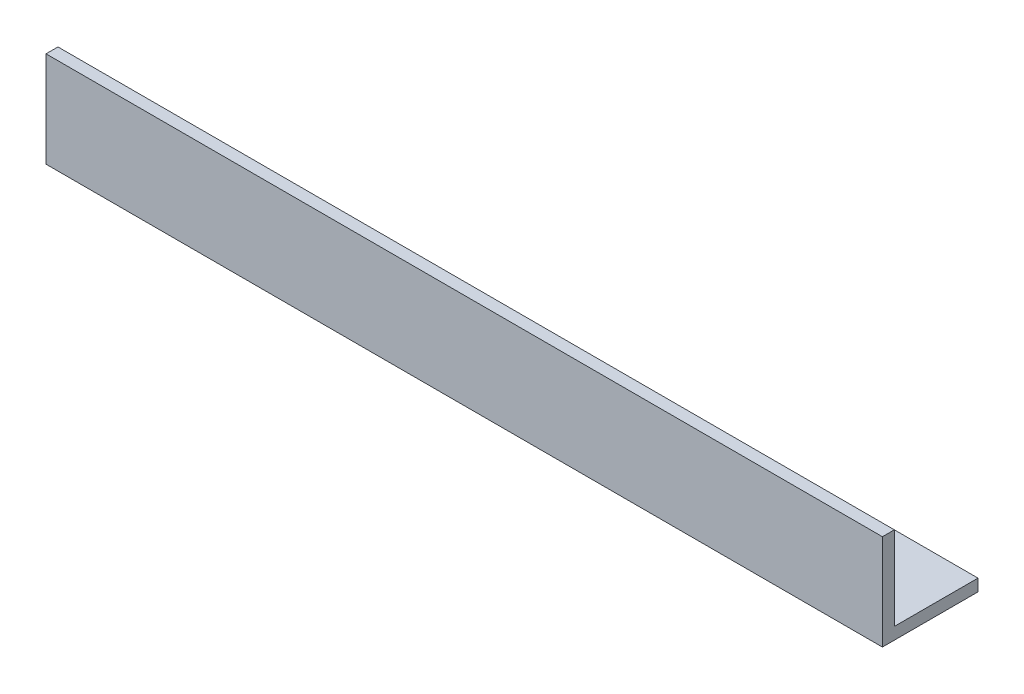
ISO-10303-21;
HEADER;
FILE_DESCRIPTION(('STEP AP214'),'2;1');
FILE_NAME('part.step','',(''),(''),'','','');
FILE_SCHEMA(('AUTOMOTIVE_DESIGN { 1 0 10303 214 1 1 1 1 }'));
ENDSEC;
DATA;
#1=APPLICATION_CONTEXT('core data for automotive mechanical design processes');
#2=APPLICATION_PROTOCOL_DEFINITION('international standard','automotive_design',2000,#1);
#3=PRODUCT_CONTEXT('',#1,'mechanical');
#4=PRODUCT('Part','Part','',(#3));
#5=PRODUCT_RELATED_PRODUCT_CATEGORY('part','',(#4));
#6=PRODUCT_DEFINITION_FORMATION('','',#4);
#7=PRODUCT_DEFINITION_CONTEXT('part definition',#1,'design');
#8=PRODUCT_DEFINITION('design','',#6,#7);
#9=PRODUCT_DEFINITION_SHAPE('','',#8);
#10=(LENGTH_UNIT() NAMED_UNIT(*) SI_UNIT(.MILLI.,.METRE.));
#11=(NAMED_UNIT(*) PLANE_ANGLE_UNIT() SI_UNIT($,.RADIAN.));
#12=(NAMED_UNIT(*) SI_UNIT($,.STERADIAN.) SOLID_ANGLE_UNIT());
#13=UNCERTAINTY_MEASURE_WITH_UNIT(LENGTH_MEASURE(1.E-05),#10,'distance_accuracy_value','');
#14=(GEOMETRIC_REPRESENTATION_CONTEXT(3) GLOBAL_UNCERTAINTY_ASSIGNED_CONTEXT((#13)) GLOBAL_UNIT_ASSIGNED_CONTEXT((#10,
#11,#12)) REPRESENTATION_CONTEXT('',''));
#15=CARTESIAN_POINT('',(0.,0.,0.));
#16=DIRECTION('',(0.,0.,1.));
#17=DIRECTION('',(1.,0.,0.));
#18=AXIS2_PLACEMENT_3D('',#15,#16,#17);
#19=CARTESIAN_POINT('',(111.125,0.,-25.4));
#20=DIRECTION('',(0.,1.,0.));
#21=DIRECTION('',(0.,0.,1.));
#22=AXIS2_PLACEMENT_3D('',#19,#20,#21);
#23=PLANE('',#22);
#24=DIRECTION('',(0.,0.,-1.));
#25=VECTOR('',#24,1.);
#26=CARTESIAN_POINT('',(-111.125,0.,-25.4));
#27=LINE('',#26,#25);
#28=CARTESIAN_POINT('',(-111.125,0.,0.));
#29=VERTEX_POINT('',#28);
#30=CARTESIAN_POINT('',(-111.125,0.,-25.4));
#31=VERTEX_POINT('',#30);
#32=EDGE_CURVE('E132',#29,#31,#27,.T.);
#33=ORIENTED_EDGE('',*,*,#32,.T.);
#34=DIRECTION('',(-1.,0.,0.));
#35=VECTOR('',#34,1.);
#36=CARTESIAN_POINT('',(111.125,0.,-25.4));
#37=LINE('',#36,#35);
#38=CARTESIAN_POINT('',(111.125,0.,-25.4));
#39=VERTEX_POINT('',#38);
#40=EDGE_CURVE('E11',#39,#31,#37,.T.);
#41=ORIENTED_EDGE('',*,*,#40,.F.);
#42=DIRECTION('',(0.,0.,-1.));
#43=VECTOR('',#42,1.);
#44=CARTESIAN_POINT('',(111.125,0.,-25.4));
#45=LINE('',#44,#43);
#46=CARTESIAN_POINT('',(111.125,0.,0.));
#47=VERTEX_POINT('',#46);
#48=EDGE_CURVE('E148',#47,#39,#45,.T.);
#49=ORIENTED_EDGE('',*,*,#48,.F.);
#50=DIRECTION('',(-1.,0.,0.));
#51=VECTOR('',#50,1.);
#52=CARTESIAN_POINT('',(111.125,0.,0.));
#53=LINE('',#52,#51);
#54=EDGE_CURVE('E128',#47,#29,#53,.T.);
#55=ORIENTED_EDGE('',*,*,#54,.T.);
#56=EDGE_LOOP('',(#33,#41,#49,#55));
#57=FACE_BOUND('',#56,.T.);
#58=ADVANCED_FACE('F43',(#57),#23,.F.);
#59=CARTESIAN_POINT('',(111.125,3.175,-25.4));
#60=DIRECTION('',(0.,0.,1.));
#61=DIRECTION('',(0.,-1.,0.));
#62=AXIS2_PLACEMENT_3D('',#59,#60,#61);
#63=PLANE('',#62);
#64=DIRECTION('',(0.,1.,0.));
#65=VECTOR('',#64,1.);
#66=CARTESIAN_POINT('',(-111.125,3.175,-25.4));
#67=LINE('',#66,#65);
#68=CARTESIAN_POINT('',(-111.125,3.175,-25.4));
#69=VERTEX_POINT('',#68);
#70=EDGE_CURVE('E136',#31,#69,#67,.T.);
#71=ORIENTED_EDGE('',*,*,#70,.T.);
#72=DIRECTION('',(-1.,0.,0.));
#73=VECTOR('',#72,1.);
#74=CARTESIAN_POINT('',(111.125,3.175,-25.4));
#75=LINE('',#74,#73);
#76=CARTESIAN_POINT('',(111.125,3.175,-25.4));
#77=VERTEX_POINT('',#76);
#78=EDGE_CURVE('E52',#77,#69,#75,.T.);
#79=ORIENTED_EDGE('',*,*,#78,.F.);
#80=DIRECTION('',(0.,1.,0.));
#81=VECTOR('',#80,1.);
#82=CARTESIAN_POINT('',(111.125,3.175,-25.4));
#83=LINE('',#82,#81);
#84=EDGE_CURVE('E97',#39,#77,#83,.T.);
#85=ORIENTED_EDGE('',*,*,#84,.F.);
#86=ORIENTED_EDGE('',*,*,#40,.T.);
#87=EDGE_LOOP('',(#71,#79,#85,#86));
#88=FACE_BOUND('',#87,.T.);
#89=ADVANCED_FACE('F176',(#88),#63,.F.);
#90=CARTESIAN_POINT('',(111.125,3.175,-3.175));
#91=DIRECTION('',(0.,-1.,0.));
#92=DIRECTION('',(0.,0.,-1.));
#93=AXIS2_PLACEMENT_3D('',#90,#91,#92);
#94=PLANE('',#93);
#95=DIRECTION('',(0.,0.,1.));
#96=VECTOR('',#95,1.);
#97=CARTESIAN_POINT('',(-111.125,3.175,-3.175));
#98=LINE('',#97,#96);
#99=CARTESIAN_POINT('',(-111.125,3.175,-3.175));
#100=VERTEX_POINT('',#99);
#101=EDGE_CURVE('E139',#69,#100,#98,.T.);
#102=ORIENTED_EDGE('',*,*,#101,.T.);
#103=DIRECTION('',(-1.,0.,0.));
#104=VECTOR('',#103,1.);
#105=CARTESIAN_POINT('',(111.125,3.175,-3.175));
#106=LINE('',#105,#104);
#107=CARTESIAN_POINT('',(111.125,3.175,-3.175));
#108=VERTEX_POINT('',#107);
#109=EDGE_CURVE('E121',#108,#100,#106,.T.);
#110=ORIENTED_EDGE('',*,*,#109,.F.);
#111=DIRECTION('',(0.,0.,1.));
#112=VECTOR('',#111,1.);
#113=CARTESIAN_POINT('',(111.125,3.175,-3.175));
#114=LINE('',#113,#112);
#115=EDGE_CURVE('E110',#77,#108,#114,.T.);
#116=ORIENTED_EDGE('',*,*,#115,.F.);
#117=ORIENTED_EDGE('',*,*,#78,.T.);
#118=EDGE_LOOP('',(#102,#110,#116,#117));
#119=FACE_BOUND('',#118,.T.);
#120=ADVANCED_FACE('F158',(#119),#94,.F.);
#121=CARTESIAN_POINT('',(111.125,25.4,-3.175));
#122=DIRECTION('',(0.,0.,1.));
#123=DIRECTION('',(0.,-1.,0.));
#124=AXIS2_PLACEMENT_3D('',#121,#122,#123);
#125=PLANE('',#124);
#126=DIRECTION('',(0.,1.,0.));
#127=VECTOR('',#126,1.);
#128=CARTESIAN_POINT('',(-111.125,25.4,-3.175));
#129=LINE('',#128,#127);
#130=CARTESIAN_POINT('',(-111.125,25.4,-3.175));
#131=VERTEX_POINT('',#130);
#132=EDGE_CURVE('E119',#100,#131,#129,.T.);
#133=ORIENTED_EDGE('',*,*,#132,.T.);
#134=DIRECTION('',(-1.,0.,0.));
#135=VECTOR('',#134,1.);
#136=CARTESIAN_POINT('',(111.125,25.4,-3.175));
#137=LINE('',#136,#135);
#138=CARTESIAN_POINT('',(111.125,25.4,-3.175));
#139=VERTEX_POINT('',#138);
#140=EDGE_CURVE('E116',#139,#131,#137,.T.);
#141=ORIENTED_EDGE('',*,*,#140,.F.);
#142=DIRECTION('',(0.,1.,0.));
#143=VECTOR('',#142,1.);
#144=CARTESIAN_POINT('',(111.125,25.4,-3.175));
#145=LINE('',#144,#143);
#146=EDGE_CURVE('E104',#108,#139,#145,.T.);
#147=ORIENTED_EDGE('',*,*,#146,.F.);
#148=ORIENTED_EDGE('',*,*,#109,.T.);
#149=EDGE_LOOP('',(#133,#141,#147,#148));
#150=FACE_BOUND('',#149,.T.);
#151=ADVANCED_FACE('F117',(#150),#125,.F.);
#152=CARTESIAN_POINT('',(111.125,25.4,0.));
#153=DIRECTION('',(0.,-1.,0.));
#154=DIRECTION('',(0.,0.,-1.));
#155=AXIS2_PLACEMENT_3D('',#152,#153,#154);
#156=PLANE('',#155);
#157=DIRECTION('',(0.,0.,1.));
#158=VECTOR('',#157,1.);
#159=CARTESIAN_POINT('',(-111.125,25.4,0.));
#160=LINE('',#159,#158);
#161=CARTESIAN_POINT('',(-111.125,25.4,0.));
#162=VERTEX_POINT('',#161);
#163=EDGE_CURVE('E83',#131,#162,#160,.T.);
#164=ORIENTED_EDGE('',*,*,#163,.T.);
#165=DIRECTION('',(-1.,0.,0.));
#166=VECTOR('',#165,1.);
#167=CARTESIAN_POINT('',(111.125,25.4,0.));
#168=LINE('',#167,#166);
#169=CARTESIAN_POINT('',(111.125,25.4,0.));
#170=VERTEX_POINT('',#169);
#171=EDGE_CURVE('E122',#170,#162,#168,.T.);
#172=ORIENTED_EDGE('',*,*,#171,.F.);
#173=DIRECTION('',(0.,0.,1.));
#174=VECTOR('',#173,1.);
#175=CARTESIAN_POINT('',(111.125,25.4,0.));
#176=LINE('',#175,#174);
#177=EDGE_CURVE('E108',#139,#170,#176,.T.);
#178=ORIENTED_EDGE('',*,*,#177,.F.);
#179=ORIENTED_EDGE('',*,*,#140,.T.);
#180=EDGE_LOOP('',(#164,#172,#178,#179));
#181=FACE_BOUND('',#180,.T.);
#182=ADVANCED_FACE('F124',(#181),#156,.F.);
#183=CARTESIAN_POINT('',(111.125,0.,0.));
#184=DIRECTION('',(0.,0.,-1.));
#185=DIRECTION('',(-1.,0.,0.));
#186=AXIS2_PLACEMENT_3D('',#183,#184,#185);
#187=PLANE('',#186);
#188=DIRECTION('',(0.,-1.,0.));
#189=VECTOR('',#188,1.);
#190=CARTESIAN_POINT('',(-111.125,0.,0.));
#191=LINE('',#190,#189);
#192=EDGE_CURVE('E89',#162,#29,#191,.T.);
#193=ORIENTED_EDGE('',*,*,#192,.T.);
#194=ORIENTED_EDGE('',*,*,#54,.F.);
#195=DIRECTION('',(0.,-1.,0.));
#196=VECTOR('',#195,1.);
#197=CARTESIAN_POINT('',(111.125,0.,0.));
#198=LINE('',#197,#196);
#199=EDGE_CURVE('E60',#170,#47,#198,.T.);
#200=ORIENTED_EDGE('',*,*,#199,.F.);
#201=ORIENTED_EDGE('',*,*,#171,.T.);
#202=EDGE_LOOP('',(#193,#194,#200,#201));
#203=FACE_BOUND('',#202,.T.);
#204=ADVANCED_FACE('F165',(#203),#187,.F.);
#205=CARTESIAN_POINT('',(111.125,0.,0.));
#206=DIRECTION('',(-1.,0.,0.));
#207=DIRECTION('',(0.,0.,1.));
#208=AXIS2_PLACEMENT_3D('',#205,#206,#207);
#209=PLANE('',#208);
#210=ORIENTED_EDGE('',*,*,#48,.T.);
#211=ORIENTED_EDGE('',*,*,#84,.T.);
#212=ORIENTED_EDGE('',*,*,#115,.T.);
#213=ORIENTED_EDGE('',*,*,#146,.T.);
#214=ORIENTED_EDGE('',*,*,#177,.T.);
#215=ORIENTED_EDGE('',*,*,#199,.T.);
#216=EDGE_LOOP('',(#210,#211,#212,#213,#214,#215));
#217=FACE_BOUND('',#216,.T.);
#218=ADVANCED_FACE('F106',(#217),#209,.F.);
#219=CARTESIAN_POINT('',(-111.125,0.,0.));
#220=DIRECTION('',(-1.,0.,0.));
#221=DIRECTION('',(0.,0.,1.));
#222=AXIS2_PLACEMENT_3D('',#219,#220,#221);
#223=PLANE('',#222);
#224=ORIENTED_EDGE('',*,*,#32,.F.);
#225=ORIENTED_EDGE('',*,*,#192,.F.);
#226=ORIENTED_EDGE('',*,*,#163,.F.);
#227=ORIENTED_EDGE('',*,*,#132,.F.);
#228=ORIENTED_EDGE('',*,*,#101,.F.);
#229=ORIENTED_EDGE('',*,*,#70,.F.);
#230=EDGE_LOOP('',(#224,#225,#226,#227,#228,#229));
#231=FACE_BOUND('',#230,.T.);
#232=ADVANCED_FACE('F161',(#231),#223,.T.);
#233=CLOSED_SHELL('',(#58,#89,#120,#151,#182,#204,#218,#232));
#234=MANIFOLD_SOLID_BREP('B2',#233);
#235=ADVANCED_BREP_SHAPE_REPRESENTATION('',(#18,#234),#14);
#236=SHAPE_DEFINITION_REPRESENTATION(#9,#235);
ENDSEC;
END-ISO-10303-21;
